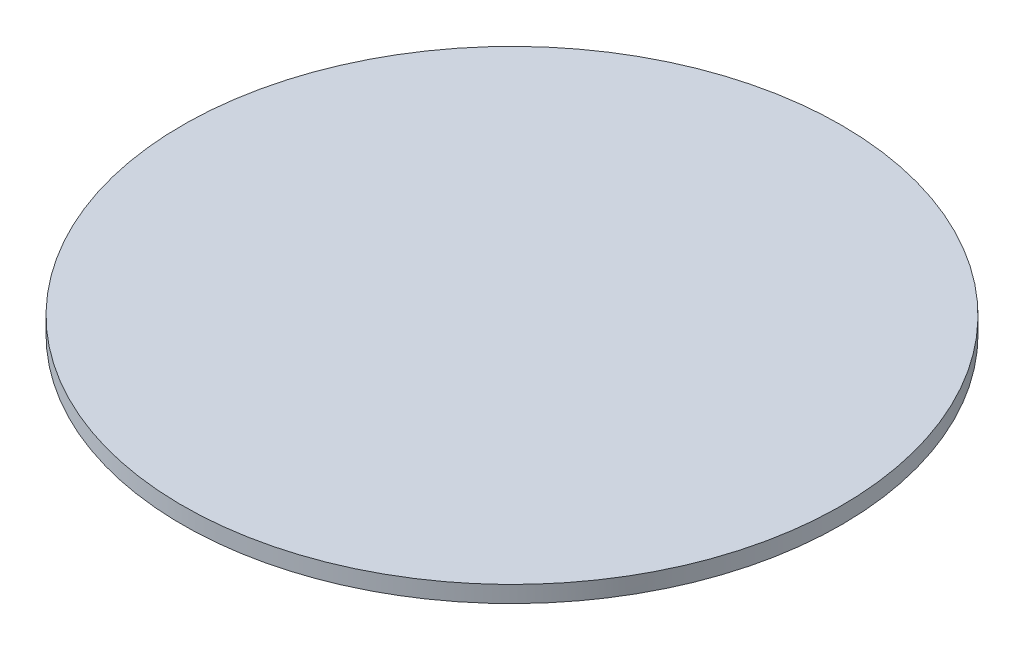
ISO-10303-21;
HEADER;
FILE_DESCRIPTION(('STEP AP214'),'2;1');
FILE_NAME('part.step','',(''),(''),'','','');
FILE_SCHEMA(('AUTOMOTIVE_DESIGN { 1 0 10303 214 1 1 1 1 }'));
ENDSEC;
DATA;
#1=APPLICATION_CONTEXT('core data for automotive mechanical design processes');
#2=APPLICATION_PROTOCOL_DEFINITION('international standard','automotive_design',2000,#1);
#3=PRODUCT_CONTEXT('',#1,'mechanical');
#4=PRODUCT('Part','Part','',(#3));
#5=PRODUCT_RELATED_PRODUCT_CATEGORY('part','',(#4));
#6=PRODUCT_DEFINITION_FORMATION('','',#4);
#7=PRODUCT_DEFINITION_CONTEXT('part definition',#1,'design');
#8=PRODUCT_DEFINITION('design','',#6,#7);
#9=PRODUCT_DEFINITION_SHAPE('','',#8);
#10=(LENGTH_UNIT() NAMED_UNIT(*) SI_UNIT(.MILLI.,.METRE.));
#11=(NAMED_UNIT(*) PLANE_ANGLE_UNIT() SI_UNIT($,.RADIAN.));
#12=(NAMED_UNIT(*) SI_UNIT($,.STERADIAN.) SOLID_ANGLE_UNIT());
#13=UNCERTAINTY_MEASURE_WITH_UNIT(LENGTH_MEASURE(1.E-05),#10,'distance_accuracy_value','');
#14=(GEOMETRIC_REPRESENTATION_CONTEXT(3) GLOBAL_UNCERTAINTY_ASSIGNED_CONTEXT((#13)) GLOBAL_UNIT_ASSIGNED_CONTEXT((#10,
#11,#12)) REPRESENTATION_CONTEXT('',''));
#15=CARTESIAN_POINT('',(0.,0.,0.));
#16=DIRECTION('',(0.,0.,1.));
#17=DIRECTION('',(1.,0.,0.));
#18=AXIS2_PLACEMENT_3D('',#15,#16,#17);
#19=CARTESIAN_POINT('',(21.2731331748166,3.24918533795984,102.377891347207));
#20=CARTESIAN_POINT('',(22.5518424825592,3.24918533795984,102.377891347207));
#21=CARTESIAN_POINT('',(25.1092610980446,3.24918533795984,102.629775095617));
#22=CARTESIAN_POINT('',(28.7979687765083,3.24918533795984,103.748732336676));
#23=CARTESIAN_POINT('',(32.1975012427753,3.24918533795984,105.565820296922));
#24=CARTESIAN_POINT('',(35.177216370647,3.24918533795984,108.011209305078));
#25=CARTESIAN_POINT('',(37.6226053788025,3.24918533795984,110.99092443295));
#26=CARTESIAN_POINT('',(39.4396933390486,3.24918533795984,114.390456899217));
#27=CARTESIAN_POINT('',(40.5586505801075,3.24918533795984,118.07916457768));
#28=CARTESIAN_POINT('',(40.9364762027238,3.24918533795984,121.915292500908));
#29=CARTESIAN_POINT('',(40.5586505801075,3.24918533795984,125.751420424136));
#30=CARTESIAN_POINT('',(39.4396933390486,3.24918533795984,129.4401281026));
#31=CARTESIAN_POINT('',(37.6226053788025,3.24918533795984,132.839660568867));
#32=CARTESIAN_POINT('',(35.177216370647,3.24918533795984,135.819375696739));
#33=CARTESIAN_POINT('',(32.1975012427753,3.24918533795984,138.264764704894));
#34=CARTESIAN_POINT('',(28.7979687765083,3.24918533795984,140.08185266514));
#35=CARTESIAN_POINT('',(25.1092610980446,3.24918533795984,141.200809906199));
#36=CARTESIAN_POINT('',(21.2731331748166,3.24918533795984,141.578635528816));
#37=CARTESIAN_POINT('',(17.4370052515886,3.24918533795984,141.200809906199));
#38=CARTESIAN_POINT('',(13.7482975731249,3.24918533795984,140.08185266514));
#39=CARTESIAN_POINT('',(10.3487651068578,3.24918533795984,138.264764704894));
#40=CARTESIAN_POINT('',(7.36904997898615,3.24918533795984,135.819375696739));
#41=CARTESIAN_POINT('',(4.92366097083058,3.24918533795984,132.839660568867));
#42=CARTESIAN_POINT('',(3.10657301058456,3.24918533795984,129.4401281026));
#43=CARTESIAN_POINT('',(1.98761576952567,3.24918533795984,125.751420424136));
#44=CARTESIAN_POINT('',(1.60979014690934,3.24918533795984,121.915292500908));
#45=CARTESIAN_POINT('',(1.98761576952566,3.24918533795984,118.07916457768));
#46=CARTESIAN_POINT('',(3.10657301058456,3.24918533795984,114.390456899217));
#47=CARTESIAN_POINT('',(4.92366097083058,3.24918533795984,110.99092443295));
#48=CARTESIAN_POINT('',(7.36904997898614,3.24918533795984,108.011209305078));
#49=CARTESIAN_POINT('',(10.3487651068578,3.24918533795984,105.565820296922));
#50=CARTESIAN_POINT('',(13.7482975731249,3.24918533795984,103.748732336676));
#51=CARTESIAN_POINT('',(17.4370052515886,3.24918533795984,102.629775095617));
#52=CARTESIAN_POINT('',(19.9944238670739,3.24918533795984,102.377891347207));
#53=CARTESIAN_POINT('',(21.2731331748166,3.24918533795984,102.377891347207));
#54=B_SPLINE_CURVE_WITH_KNOTS('',3,(#19,#20,#21,#22,#23,#24,#25,#26,#27,#28,#29,#30,#31,#32,#33,
#34,#35,#36,#37,#38,#39,#40,#41,#42,#43,#44,#45,#46,#47,#48,#49,#50,#51,#52,#53),.UNSPECIFIED.,
.T.,.F.,(4,1,1,1,1,1,1,1,1,1,1,1,1,1,1,1,1,1,1,1,1,1,1,1,1,1,1,1,1,1,1,1,4),(0.,
0.0312499999999999,0.0625,0.09375,0.125,0.15625,0.1875,0.21875,0.25,0.28125,0.3125,0.34375,
0.375,0.40625,0.4375,0.46875,0.5,0.53125,0.5625,0.59375,0.625,0.65625,0.6875,0.71875,0.75,
0.78125,0.8125,0.84375,0.875,0.90625,0.9375,0.96875,1.),.UNSPECIFIED.);
#55=DIRECTION('',(0.,-1.,0.));
#56=VECTOR('',#55,1.);
#57=SURFACE_OF_LINEAR_EXTRUSION('',#54,#56);
#58=CARTESIAN_POINT('',(21.2731331748166,3.24918533795984,102.377891347207));
#59=CARTESIAN_POINT('',(22.5518424825592,3.24918533795984,102.377891347207));
#60=CARTESIAN_POINT('',(25.1092610980446,3.24918533795984,102.629775095617));
#61=CARTESIAN_POINT('',(28.7979687765083,3.24918533795984,103.748732336676));
#62=CARTESIAN_POINT('',(32.1975012427753,3.24918533795984,105.565820296922));
#63=CARTESIAN_POINT('',(35.177216370647,3.24918533795984,108.011209305078));
#64=CARTESIAN_POINT('',(37.6226053788025,3.24918533795984,110.99092443295));
#65=CARTESIAN_POINT('',(39.4396933390486,3.24918533795984,114.390456899217));
#66=CARTESIAN_POINT('',(40.5586505801075,3.24918533795984,118.07916457768));
#67=CARTESIAN_POINT('',(40.9364762027238,3.24918533795984,121.915292500908));
#68=CARTESIAN_POINT('',(40.5586505801075,3.24918533795984,125.751420424136));
#69=CARTESIAN_POINT('',(39.4396933390486,3.24918533795984,129.4401281026));
#70=CARTESIAN_POINT('',(37.6226053788025,3.24918533795984,132.839660568867));
#71=CARTESIAN_POINT('',(35.177216370647,3.24918533795984,135.819375696739));
#72=CARTESIAN_POINT('',(32.1975012427753,3.24918533795984,138.264764704894));
#73=CARTESIAN_POINT('',(28.7979687765083,3.24918533795984,140.08185266514));
#74=CARTESIAN_POINT('',(25.1092610980446,3.24918533795984,141.200809906199));
#75=CARTESIAN_POINT('',(21.2731331748166,3.24918533795984,141.578635528816));
#76=CARTESIAN_POINT('',(17.4370052515886,3.24918533795984,141.200809906199));
#77=CARTESIAN_POINT('',(13.7482975731249,3.24918533795984,140.08185266514));
#78=CARTESIAN_POINT('',(10.3487651068578,3.24918533795984,138.264764704894));
#79=CARTESIAN_POINT('',(7.36904997898615,3.24918533795984,135.819375696739));
#80=CARTESIAN_POINT('',(4.92366097083058,3.24918533795984,132.839660568867));
#81=CARTESIAN_POINT('',(3.10657301058456,3.24918533795984,129.4401281026));
#82=CARTESIAN_POINT('',(1.98761576952567,3.24918533795984,125.751420424136));
#83=CARTESIAN_POINT('',(1.60979014690934,3.24918533795984,121.915292500908));
#84=CARTESIAN_POINT('',(1.98761576952566,3.24918533795984,118.07916457768));
#85=CARTESIAN_POINT('',(3.10657301058456,3.24918533795984,114.390456899217));
#86=CARTESIAN_POINT('',(4.92366097083058,3.24918533795984,110.99092443295));
#87=CARTESIAN_POINT('',(7.36904997898614,3.24918533795984,108.011209305078));
#88=CARTESIAN_POINT('',(10.3487651068578,3.24918533795984,105.565820296922));
#89=CARTESIAN_POINT('',(13.7482975731249,3.24918533795984,103.748732336676));
#90=CARTESIAN_POINT('',(17.4370052515886,3.24918533795984,102.629775095617));
#91=CARTESIAN_POINT('',(19.9944238670739,3.24918533795984,102.377891347207));
#92=CARTESIAN_POINT('',(21.2731331748166,3.24918533795984,102.377891347207));
#93=B_SPLINE_CURVE_WITH_KNOTS('',3,(#58,#59,#60,#61,#62,#63,#64,#65,#66,#67,#68,#69,#70,#71,#72,
#73,#74,#75,#76,#77,#78,#79,#80,#81,#82,#83,#84,#85,#86,#87,#88,#89,#90,#91,#92),.UNSPECIFIED.,
.T.,.F.,(4,1,1,1,1,1,1,1,1,1,1,1,1,1,1,1,1,1,1,1,1,1,1,1,1,1,1,1,1,1,1,1,4),(0.,
0.0312499999999999,0.0625,0.09375,0.125,0.15625,0.1875,0.21875,0.25,0.28125,0.3125,0.34375,
0.375,0.40625,0.4375,0.46875,0.5,0.53125,0.5625,0.59375,0.625,0.65625,0.6875,0.71875,0.75,
0.78125,0.8125,0.84375,0.875,0.90625,0.9375,0.96875,1.),.UNSPECIFIED.);
#94=CARTESIAN_POINT('',(21.2731331748166,3.24918533795984,102.377891347207));
#95=VERTEX_POINT('',#94);
#96=EDGE_CURVE('E9',#95,#95,#93,.T.);
#97=ORIENTED_EDGE('',*,*,#96,.T.);
#98=EDGE_LOOP('',(#97));
#99=FACE_BOUND('',#98,.T.);
#100=CARTESIAN_POINT('',(21.2731331748166,2.26610024094684,102.377891347207));
#101=CARTESIAN_POINT('',(20.9534538849464,2.26610024094684,102.377891413515));
#102=CARTESIAN_POINT('',(20.6337769216615,2.26610024094684,102.385762808348));
#103=CARTESIAN_POINT('',(19.9951907999093,2.26610024094684,102.417172587829));
#104=CARTESIAN_POINT('',(19.6762816474255,2.26610024094684,102.440711094176));
#105=CARTESIAN_POINT('',(19.0399992891781,2.26610024094684,102.503379427095));
#106=CARTESIAN_POINT('',(18.7226260834145,2.26610024094684,102.542509253668));
#107=CARTESIAN_POINT('',(18.0901818096652,2.26610024094684,102.636285079453));
#108=CARTESIAN_POINT('',(17.7751107238161,2.26610024094684,102.690930958136));
#109=CARTESIAN_POINT('',(17.1480398609491,2.26610024094684,102.815663105913));
#110=CARTESIAN_POINT('',(16.8360400839313,2.26610024094684,102.885749375006));
#111=CARTESIAN_POINT('',(16.2158512640616,2.26610024094684,103.041137771615));
#112=CARTESIAN_POINT('',(15.9076622508299,2.26610024094684,103.126440017321));
#113=CARTESIAN_POINT('',(15.2958320512569,2.26610024094684,103.31203667904));
#114=CARTESIAN_POINT('',(14.9921908649155,2.26610024094684,103.412331095052));
#115=CARTESIAN_POINT('',(14.3901935366709,2.26610024094684,103.627688814235));
#116=CARTESIAN_POINT('',(14.0918373537326,2.26610024094684,103.742752002677));
#117=CARTESIAN_POINT('',(13.501149529916,2.26610024094684,103.987422910405));
#118=CARTESIAN_POINT('',(13.2088178890376,2.26610024094684,104.11703062969));
#119=CARTESIAN_POINT('',(12.6308605921862,2.26610024094684,104.390426119311));
#120=CARTESIAN_POINT('',(12.3452349883222,2.26610024094684,104.534213999788));
#121=CARTESIAN_POINT('',(11.7813690479351,2.26610024094684,104.835606624106));
#122=CARTESIAN_POINT('',(11.503128711412,2.26610024094684,104.993211367947));
#123=CARTESIAN_POINT('',(10.9547127995542,2.26610024094684,105.321874901627));
#124=CARTESIAN_POINT('',(10.6845371615907,2.26610024094684,105.492933586949));
#125=CARTESIAN_POINT('',(10.1529321649234,2.26610024094684,105.848140689533));
#126=CARTESIAN_POINT('',(9.89150280621962,2.26610024094684,106.032289106795));
#127=CARTESIAN_POINT('',(9.37798761085564,2.26610024094684,106.413185253903));
#128=CARTESIAN_POINT('',(9.12590184679061,2.26610024094684,106.609933081608));
#129=CARTESIAN_POINT('',(8.63166921647461,2.26610024094684,107.015539319044));
#130=CARTESIAN_POINT('',(8.38952235022364,2.26610024094684,107.224397728775));
#131=CARTESIAN_POINT('',(7.91576317095395,2.26610024094684,107.653736721657));
#132=CARTESIAN_POINT('',(7.68415077611925,2.26610024094684,107.874217214517));
#133=CARTESIAN_POINT('',(7.23205788842505,2.26610024094684,108.326310102211));
#134=CARTESIAN_POINT('',(7.01157739556555,2.26610024094684,108.557922497046));
#135=CARTESIAN_POINT('',(6.5822384026831,2.26610024094684,109.031681676315));
#136=CARTESIAN_POINT('',(6.37337999295179,2.26610024094684,109.273828542566));
#137=CARTESIAN_POINT('',(5.967773755516,2.26610024094684,109.768061172882));
#138=CARTESIAN_POINT('',(5.77102592781153,2.26610024094684,110.020146936947));
#139=CARTESIAN_POINT('',(5.39012978070341,2.26610024094684,110.533662132311));
#140=CARTESIAN_POINT('',(5.20598136344083,2.26610024094684,110.795091491015));
#141=CARTESIAN_POINT('',(4.85077426085684,2.26610024094684,111.326696487682));
#142=CARTESIAN_POINT('',(4.67971557553542,2.26610024094684,111.596872125645));
#143=CARTESIAN_POINT('',(4.35105204185499,2.26610024094684,112.145288037504));
#144=CARTESIAN_POINT('',(4.19344729801418,2.26610024094684,112.423528374029));
#145=CARTESIAN_POINT('',(3.89205467369665,2.26610024094684,112.987394314411));
#146=CARTESIAN_POINT('',(3.74826679321992,2.26610024094684,113.273019918268));
#147=CARTESIAN_POINT('',(3.47487130359773,2.26610024094684,113.850977215139));
#148=CARTESIAN_POINT('',(3.34526358431105,2.26610024094684,114.143308856043));
#149=CARTESIAN_POINT('',(3.10059267658712,2.26610024094684,114.733996679789));
#150=CARTESIAN_POINT('',(2.98552948814987,2.26610024094684,115.032352862629));
#151=CARTESIAN_POINT('',(2.77017176895415,2.26610024094684,115.63435019114));
#152=CARTESIAN_POINT('',(2.66987735292391,2.26610024094684,115.937991377846));
#153=CARTESIAN_POINT('',(2.48428069125422,2.26610024094684,116.549821576424));
#154=CARTESIAN_POINT('',(2.39897844561477,2.26610024094684,116.858010588298));
#155=CARTESIAN_POINT('',(2.24359004882273,2.26610024094684,117.478199411878));
#156=CARTESIAN_POINT('',(2.17350377947929,2.26610024094684,117.790199193965));
#157=CARTESIAN_POINT('',(2.04877163238623,2.26610024094684,118.417270042984));
#158=CARTESIAN_POINT('',(1.99412575463661,2.26610024094684,118.732341109916));
#159=CARTESIAN_POINT('',(1.90034992630031,2.26610024094684,119.364785435348));
#160=CARTESIAN_POINT('',(1.86122009624291,2.26610024094684,119.682158711712));
#161=CARTESIAN_POINT('',(1.79855177284522,2.26610024094684,120.318440877075));
#162=CARTESIAN_POINT('',(1.77501327950494,2.26610024094684,120.637349766073));
#163=CARTESIAN_POINT('',(1.74360346448895,2.26610024094684,121.275936607679));
#164=CARTESIAN_POINT('',(1.73573202111478,2.26610024094684,121.595614554294));
#165=CARTESIAN_POINT('',(1.73573202111478,2.26610024094684,122.234970447523));
#166=CARTESIAN_POINT('',(1.74360346448895,2.26610024094684,122.554648394138));
#167=CARTESIAN_POINT('',(1.77501327950494,2.26610024094684,123.193235235744));
#168=CARTESIAN_POINT('',(1.79855177284523,2.26610024094684,123.512144124742));
#169=CARTESIAN_POINT('',(1.86122009624291,2.26610024094684,124.148426290104));
#170=CARTESIAN_POINT('',(1.90034992630031,2.26610024094684,124.465799566469));
#171=CARTESIAN_POINT('',(1.99412575463661,2.26610024094684,125.098243891901));
#172=CARTESIAN_POINT('',(2.04877163238623,2.26610024094684,125.413314958833));
#173=CARTESIAN_POINT('',(2.17350377947929,2.26610024094684,126.040385807852));
#174=CARTESIAN_POINT('',(2.24359004882273,2.26610024094684,126.352385589938));
#175=CARTESIAN_POINT('',(2.39897844561477,2.26610024094684,126.972574413519));
#176=CARTESIAN_POINT('',(2.48428069125422,2.26610024094684,127.280763425392));
#177=CARTESIAN_POINT('',(2.66987735292391,2.26610024094684,127.892593623971));
#178=CARTESIAN_POINT('',(2.77017176895415,2.26610024094684,128.196234810676));
#179=CARTESIAN_POINT('',(2.98552948814986,2.26610024094684,128.798232139187));
#180=CARTESIAN_POINT('',(3.10059267658712,2.26610024094684,129.096588322028));
#181=CARTESIAN_POINT('',(3.34526358431105,2.26610024094684,129.687276145773));
#182=CARTESIAN_POINT('',(3.47487130359772,2.26610024094684,129.979607786678));
#183=CARTESIAN_POINT('',(3.74826679321991,2.26610024094684,130.557565083548));
#184=CARTESIAN_POINT('',(3.89205467369665,2.26610024094684,130.843190687405));
#185=CARTESIAN_POINT('',(4.19344729801418,2.26610024094684,131.407056627787));
#186=CARTESIAN_POINT('',(4.35105204185498,2.26610024094684,131.685296964312));
#187=CARTESIAN_POINT('',(4.67971557553541,2.26610024094684,132.233712876171));
#188=CARTESIAN_POINT('',(4.85077426085683,2.26610024094684,132.503888514134));
#189=CARTESIAN_POINT('',(5.20598136344083,2.26610024094684,133.035493510801));
#190=CARTESIAN_POINT('',(5.39012978070341,2.26610024094684,133.296922869505));
#191=CARTESIAN_POINT('',(5.77102592781152,2.26610024094684,133.810438064869));
#192=CARTESIAN_POINT('',(5.96777375551599,2.26610024094684,134.062523828934));
#193=CARTESIAN_POINT('',(6.37337999295178,2.26610024094684,134.55675645925));
#194=CARTESIAN_POINT('',(6.5822384026831,2.26610024094684,134.798903325501));
#195=CARTESIAN_POINT('',(7.01157739556555,2.26610024094684,135.272662504771));
#196=CARTESIAN_POINT('',(7.23205788842504,2.26610024094684,135.504274899606));
#197=CARTESIAN_POINT('',(7.68415077611924,2.26610024094684,135.9563677873));
#198=CARTESIAN_POINT('',(7.91576317095394,2.26610024094684,136.176848280159));
#199=CARTESIAN_POINT('',(8.38952235022364,2.26610024094684,136.606187273042));
#200=CARTESIAN_POINT('',(8.63166921647462,2.26610024094684,136.815045682773));
#201=CARTESIAN_POINT('',(9.12590184679059,2.26610024094684,137.220651920209));
#202=CARTESIAN_POINT('',(9.37798761085558,2.26610024094684,137.417399747913));
#203=CARTESIAN_POINT('',(9.89150280621966,2.26610024094684,137.798295895021));
#204=CARTESIAN_POINT('',(10.1529321649235,2.26610024094684,137.982444312284));
#205=CARTESIAN_POINT('',(10.6845371615905,2.26610024094684,138.337651414868));
#206=CARTESIAN_POINT('',(10.9547127995535,2.26610024094684,138.508710100189));
#207=CARTESIAN_POINT('',(11.5031287114127,2.26610024094684,138.83737363387));
#208=CARTESIAN_POINT('',(11.7813690479376,2.26610024094684,138.994978377711));
#209=CARTESIAN_POINT('',(12.3452349883196,2.26610024094684,139.296371002028));
#210=CARTESIAN_POINT('',(12.6308605921766,2.26610024094684,139.440158882505));
#211=CARTESIAN_POINT('',(13.2088178890471,2.26610024094684,139.713554372127));
#212=CARTESIAN_POINT('',(13.5011495299517,2.26610024094684,139.843162091414));
#213=CARTESIAN_POINT('',(14.0918373536969,2.26610024094684,140.087832999138));
#214=CARTESIAN_POINT('',(14.3901935365376,2.26610024094684,140.202896187575));
#215=CARTESIAN_POINT('',(14.9921908650487,2.26610024094684,140.418253906771));
#216=CARTESIAN_POINT('',(15.295832051754,2.26610024094684,140.518548322801));
#217=CARTESIAN_POINT('',(15.9076622503328,2.26610024094684,140.704144984471));
#218=CARTESIAN_POINT('',(16.2158512622062,2.26610024094684,140.78944723011));
#219=CARTESIAN_POINT('',(16.8360400857866,2.26610024094684,140.944835626902));
#220=CARTESIAN_POINT('',(17.1480398678733,2.26610024094684,141.014921896246));
#221=CARTESIAN_POINT('',(17.7751107168919,2.26610024094684,141.139654043339));
#222=CARTESIAN_POINT('',(18.0901817838238,2.26610024094684,141.194299921088));
#223=CARTESIAN_POINT('',(18.722626109256,2.26610024094684,141.288075749425));
#224=CARTESIAN_POINT('',(19.0399993856206,2.26610024094684,141.327205579482));
#225=CARTESIAN_POINT('',(19.676281550983,2.26610024094684,141.38987390288));
#226=CARTESIAN_POINT('',(19.995190439981,2.26610024094684,141.41341239622));
#227=CARTESIAN_POINT('',(20.633777281587,2.26610024094684,141.444822211236));
#228=CARTESIAN_POINT('',(20.9534552282018,2.26610024094684,141.45269365461));
#229=CARTESIAN_POINT('',(21.5928111214313,2.26610024094684,141.45269365461));
#230=CARTESIAN_POINT('',(21.9124890680461,2.26610024094684,141.444822211236));
#231=CARTESIAN_POINT('',(22.5510759096521,2.26610024094684,141.41341239622));
#232=CARTESIAN_POINT('',(22.86998479865,2.26610024094684,141.38987390288));
#233=CARTESIAN_POINT('',(23.5062669640125,2.26610024094684,141.327205579482));
#234=CARTESIAN_POINT('',(23.823640240377,2.26610024094684,141.288075749425));
#235=CARTESIAN_POINT('',(24.4560845658093,2.26610024094684,141.194299921088));
#236=CARTESIAN_POINT('',(24.7711556327412,2.26610024094684,141.139654043339));
#237=CARTESIAN_POINT('',(25.3982264817598,2.26610024094684,141.014921896246));
#238=CARTESIAN_POINT('',(25.7102262638465,2.26610024094684,140.944835626902));
#239=CARTESIAN_POINT('',(26.3304150874269,2.26610024094684,140.78944723011));
#240=CARTESIAN_POINT('',(26.6386040993003,2.26610024094684,140.704144984471));
#241=CARTESIAN_POINT('',(27.2504342978791,2.26610024094684,140.518548322801));
#242=CARTESIAN_POINT('',(27.5540754845844,2.26610024094684,140.418253906771));
#243=CARTESIAN_POINT('',(28.1560728130955,2.26610024094684,140.202896187575));
#244=CARTESIAN_POINT('',(28.4544289959362,2.26610024094684,140.087832999138));
#245=CARTESIAN_POINT('',(29.0451168196814,2.26610024094684,139.843162091414));
#246=CARTESIAN_POINT('',(29.337448460586,2.26610024094684,139.713554372127));
#247=CARTESIAN_POINT('',(29.9154057574565,2.26610024094684,139.440158882505));
#248=CARTESIAN_POINT('',(30.2010313613135,2.26610024094684,139.296371002028));
#249=CARTESIAN_POINT('',(30.7648973016954,2.26610024094684,138.994978377711));
#250=CARTESIAN_POINT('',(31.0431376382204,2.26610024094684,138.83737363387));
#251=CARTESIAN_POINT('',(31.5915535500796,2.26610024094684,138.508710100189));
#252=CARTESIAN_POINT('',(31.8617291880426,2.26610024094684,138.337651414868));
#253=CARTESIAN_POINT('',(32.3933341847096,2.26610024094684,137.982444312284));
#254=CARTESIAN_POINT('',(32.6547635434134,2.26610024094684,137.798295895021));
#255=CARTESIAN_POINT('',(33.1682787387775,2.26610024094684,137.417399747913));
#256=CARTESIAN_POINT('',(33.4203645028425,2.26610024094684,137.220651920209));
#257=CARTESIAN_POINT('',(33.9145971331585,2.26610024094684,136.815045682773));
#258=CARTESIAN_POINT('',(34.1567439994095,2.26610024094684,136.606187273042));
#259=CARTESIAN_POINT('',(34.6305031786791,2.26610024094684,136.176848280159));
#260=CARTESIAN_POINT('',(34.8621155735139,2.26610024094684,135.9563677873));
#261=CARTESIAN_POINT('',(35.3142084612081,2.26610024094684,135.504274899606));
#262=CARTESIAN_POINT('',(35.5346889540676,2.26610024094684,135.272662504771));
#263=CARTESIAN_POINT('',(35.96402794695,2.26610024094684,134.798903325501));
#264=CARTESIAN_POINT('',(36.1728863566813,2.26610024094684,134.55675645925));
#265=CARTESIAN_POINT('',(36.5784925941171,2.26610024094684,134.062523828934));
#266=CARTESIAN_POINT('',(36.7752404218216,2.26610024094684,133.810438064869));
#267=CARTESIAN_POINT('',(37.1561365689297,2.26610024094684,133.296922869505));
#268=CARTESIAN_POINT('',(37.3402849861923,2.26610024094684,133.035493510801));
#269=CARTESIAN_POINT('',(37.6954920887763,2.26610024094684,132.503888514134));
#270=CARTESIAN_POINT('',(37.8665507740977,2.26610024094684,132.233712876171));
#271=CARTESIAN_POINT('',(38.1952143077781,2.26610024094684,131.685296964312));
#272=CARTESIAN_POINT('',(38.3528190516189,2.26610024094684,131.407056627787));
#273=CARTESIAN_POINT('',(38.6542116759365,2.26610024094684,130.843190687405));
#274=CARTESIAN_POINT('',(38.7979995564132,2.26610024094684,130.557565083548));
#275=CARTESIAN_POINT('',(39.0713950460354,2.26610024094684,129.979607786678));
#276=CARTESIAN_POINT('',(39.2010027653221,2.26610024094684,129.687276145773));
#277=CARTESIAN_POINT('',(39.445673673046,2.26610024094684,129.096588322028));
#278=CARTESIAN_POINT('',(39.5607368614833,2.26610024094684,128.798232139187));
#279=CARTESIAN_POINT('',(39.776094580679,2.26610024094684,128.196234810676));
#280=CARTESIAN_POINT('',(39.8763889967092,2.26610024094684,127.892593623971));
#281=CARTESIAN_POINT('',(40.0619856583789,2.26610024094684,127.280763425392));
#282=CARTESIAN_POINT('',(40.1472879040184,2.26610024094684,126.972574413519));
#283=CARTESIAN_POINT('',(40.3026763008104,2.26610024094684,126.352385589938));
#284=CARTESIAN_POINT('',(40.3727625701538,2.26610024094684,126.040385807852));
#285=CARTESIAN_POINT('',(40.4974947172469,2.26610024094684,125.413314958833));
#286=CARTESIAN_POINT('',(40.5521405949965,2.26610024094684,125.098243891901));
#287=CARTESIAN_POINT('',(40.6459164233328,2.26610024094684,124.465799566469));
#288=CARTESIAN_POINT('',(40.6850462533902,2.26610024094684,124.148426290104));
#289=CARTESIAN_POINT('',(40.7477145767879,2.26610024094684,123.512144124742));
#290=CARTESIAN_POINT('',(40.7712530701282,2.26610024094684,123.193235235744));
#291=CARTESIAN_POINT('',(40.8026628851442,2.26610024094684,122.554648394138));
#292=CARTESIAN_POINT('',(40.8105343285183,2.26610024094684,122.234970447523));
#293=CARTESIAN_POINT('',(40.8105343285183,2.26610024094684,121.595614554294));
#294=CARTESIAN_POINT('',(40.8026628851442,2.26610024094684,121.275936607679));
#295=CARTESIAN_POINT('',(40.7712530701282,2.26610024094684,120.637349766073));
#296=CARTESIAN_POINT('',(40.7477145767879,2.26610024094684,120.318440877075));
#297=CARTESIAN_POINT('',(40.6850462533902,2.26610024094684,119.682158711712));
#298=CARTESIAN_POINT('',(40.6459164233328,2.26610024094684,119.364785435348));
#299=CARTESIAN_POINT('',(40.5521405949965,2.26610024094684,118.732341109916));
#300=CARTESIAN_POINT('',(40.4974947172469,2.26610024094684,118.417270042984));
#301=CARTESIAN_POINT('',(40.3727625701538,2.26610024094684,117.790199193965));
#302=CARTESIAN_POINT('',(40.3026763008104,2.26610024094684,117.478199411878));
#303=CARTESIAN_POINT('',(40.1472879040184,2.26610024094684,116.858010588298));
#304=CARTESIAN_POINT('',(40.0619856583789,2.26610024094684,116.549821576425));
#305=CARTESIAN_POINT('',(39.8763889967092,2.26610024094684,115.937991377846));
#306=CARTESIAN_POINT('',(39.776094580679,2.26610024094684,115.63435019114));
#307=CARTESIAN_POINT('',(39.5607368614833,2.26610024094684,115.032352862629));
#308=CARTESIAN_POINT('',(39.445673673046,2.26610024094684,114.733996679789));
#309=CARTESIAN_POINT('',(39.2010027653221,2.26610024094684,114.143308856043));
#310=CARTESIAN_POINT('',(39.0713950460354,2.26610024094684,113.850977215139));
#311=CARTESIAN_POINT('',(38.7979995564132,2.26610024094684,113.273019918268));
#312=CARTESIAN_POINT('',(38.6542116759365,2.26610024094684,112.987394314411));
#313=CARTESIAN_POINT('',(38.3528190516189,2.26610024094684,112.423528374029));
#314=CARTESIAN_POINT('',(38.1952143077781,2.26610024094684,112.145288037504));
#315=CARTESIAN_POINT('',(37.8665507740977,2.26610024094684,111.596872125645));
#316=CARTESIAN_POINT('',(37.6954920887763,2.26610024094684,111.326696487682));
#317=CARTESIAN_POINT('',(37.3402849861923,2.26610024094684,110.795091491015));
#318=CARTESIAN_POINT('',(37.1561365689297,2.26610024094684,110.533662132311));
#319=CARTESIAN_POINT('',(36.7752404218216,2.26610024094684,110.020146936947));
#320=CARTESIAN_POINT('',(36.5784925941171,2.26610024094684,109.768061172882));
#321=CARTESIAN_POINT('',(36.1728863566813,2.26610024094684,109.273828542566));
#322=CARTESIAN_POINT('',(35.96402794695,2.26610024094684,109.031681676315));
#323=CARTESIAN_POINT('',(35.5346889540676,2.26610024094684,108.557922497046));
#324=CARTESIAN_POINT('',(35.3142084612081,2.26610024094684,108.326310102211));
#325=CARTESIAN_POINT('',(34.8621155735139,2.26610024094684,107.874217214517));
#326=CARTESIAN_POINT('',(34.6305031786792,2.26610024094684,107.653736721657));
#327=CARTESIAN_POINT('',(34.1567439994095,2.26610024094684,107.224397728775));
#328=CARTESIAN_POINT('',(33.9145971331585,2.26610024094684,107.015539319044));
#329=CARTESIAN_POINT('',(33.4203645028425,2.26610024094684,106.609933081608));
#330=CARTESIAN_POINT('',(33.1682787387775,2.26610024094684,106.413185253903));
#331=CARTESIAN_POINT('',(32.6547635434135,2.26610024094684,106.032289106795));
#332=CARTESIAN_POINT('',(32.3933341847098,2.26610024094684,105.848140689533));
#333=CARTESIAN_POINT('',(31.8617291880425,2.26610024094684,105.492933586949));
#334=CARTESIAN_POINT('',(31.5915535500789,2.26610024094684,105.321874901627));
#335=CARTESIAN_POINT('',(31.0431376382211,2.26610024094684,104.993211367947));
#336=CARTESIAN_POINT('',(30.764897301698,2.26610024094684,104.835606624106));
#337=CARTESIAN_POINT('',(30.2010313613109,2.26610024094684,104.534213999788));
#338=CARTESIAN_POINT('',(29.9154057574469,2.26610024094684,104.390426119311));
#339=CARTESIAN_POINT('',(29.3374484605955,2.26610024094684,104.11703062969));
#340=CARTESIAN_POINT('',(29.0451168197172,2.26610024094684,103.987422910405));
#341=CARTESIAN_POINT('',(28.4544289959005,2.26610024094684,103.742752002677));
#342=CARTESIAN_POINT('',(28.1560728129623,2.26610024094684,103.627688814235));
#343=CARTESIAN_POINT('',(27.5540754847176,2.26610024094684,103.412331095052));
#344=CARTESIAN_POINT('',(27.2504342983763,2.26610024094684,103.31203667904));
#345=CARTESIAN_POINT('',(26.6386040988032,2.26610024094684,103.126440017321));
#346=CARTESIAN_POINT('',(26.3304150855716,2.26610024094684,103.041137771615));
#347=CARTESIAN_POINT('',(25.7102262657019,2.26610024094684,102.885749375006));
#348=CARTESIAN_POINT('',(25.398226488684,2.26610024094684,102.815663105913));
#349=CARTESIAN_POINT('',(24.771155625817,2.26610024094684,102.690930958136));
#350=CARTESIAN_POINT('',(24.4560845399679,2.26610024094684,102.636285079453));
#351=CARTESIAN_POINT('',(23.8236402662187,2.26610024094684,102.542509253668));
#352=CARTESIAN_POINT('',(23.506267060455,2.26610024094684,102.503379427095));
#353=CARTESIAN_POINT('',(22.8699847022076,2.26610024094684,102.440711094176));
#354=CARTESIAN_POINT('',(22.5510755497238,2.26610024094684,102.417172587829));
#355=CARTESIAN_POINT('',(21.9124894279716,2.26610024094684,102.385762808348));
#356=CARTESIAN_POINT('',(21.5928124646867,2.26610024094684,102.377891413515));
#357=CARTESIAN_POINT('',(21.2731331748166,2.26610024094684,102.377891347207));
#358=B_SPLINE_CURVE_WITH_KNOTS('',3,(#100,#101,#102,#103,#104,#105,#106,#107,#108,#109,#110,
#111,#112,#113,#114,#115,#116,#117,#118,#119,#120,#121,#122,#123,#124,#125,#126,#127,#128,#129,
#130,#131,#132,#133,#134,#135,#136,#137,#138,#139,#140,#141,#142,#143,#144,#145,#146,#147,#148,
#149,#150,#151,#152,#153,#154,#155,#156,#157,#158,#159,#160,#161,#162,#163,#164,#165,#166,#167,
#168,#169,#170,#171,#172,#173,#174,#175,#176,#177,#178,#179,#180,#181,#182,#183,#184,#185,#186,
#187,#188,#189,#190,#191,#192,#193,#194,#195,#196,#197,#198,#199,#200,#201,#202,#203,#204,#205,
#206,#207,#208,#209,#210,#211,#212,#213,#214,#215,#216,#217,#218,#219,#220,#221,#222,#223,#224,
#225,#226,#227,#228,#229,#230,#231,#232,#233,#234,#235,#236,#237,#238,#239,#240,#241,#242,#243,
#244,#245,#246,#247,#248,#249,#250,#251,#252,#253,#254,#255,#256,#257,#258,#259,#260,#261,#262,
#263,#264,#265,#266,#267,#268,#269,#270,#271,#272,#273,#274,#275,#276,#277,#278,#279,#280,#281,
#282,#283,#284,#285,#286,#287,#288,#289,#290,#291,#292,#293,#294,#295,#296,#297,#298,#299,#300,
#301,#302,#303,#304,#305,#306,#307,#308,#309,#310,#311,#312,#313,#314,#315,#316,#317,#318,#319,
#320,#321,#322,#323,#324,#325,#326,#327,#328,#329,#330,#331,#332,#333,#334,#335,#336,#337,#338,
#339,#340,#341,#342,#343,#344,#345,#346,#347,#348,#349,#350,#351,#352,#353,#354,#355,#356,#357),
.UNSPECIFIED.,.F.,.F.,(4,2,2,2,2,2,2,2,2,2,2,2,2,2,2,2,2,2,2,2,2,2,2,2,2,2,2,2,2,2,2,2,2,2,2,2,
2,2,2,2,2,2,2,2,2,2,2,2,2,2,2,2,2,2,2,2,2,2,2,2,2,2,2,2,2,2,2,2,2,2,2,2,2,2,2,2,2,2,2,2,2,2,2,2,
2,2,2,2,2,2,2,2,2,2,2,2,2,2,2,2,2,2,2,2,2,2,2,2,2,2,2,2,2,2,2,2,2,2,2,2,2,2,2,2,2,2,2,2,4),(0.,
0.958937939115206,1.91788332715285,2.87682871519048,3.83576665430568,4.79470459342088,
5.75364998145852,6.71259536949616,7.67153330861136,8.63047124772657,9.58941663576422,
10.5483620238019,11.5072999629171,12.4662379020323,13.4251832900699,14.3841286781075,
15.3430666172227,16.3020045563379,17.2609499443756,18.2198953324132,19.1788332715284,
20.1377712106436,21.0967165986813,22.0556619867189,23.0145999258341,23.9735378649493,
24.9324832529869,25.8914286410246,26.8503665801398,27.809304519255,28.7682499072926,
29.7271952953302,30.6861332344454,31.6450711735606,32.6040165615983,33.5629619496359,
34.5218998887511,35.4808378278664,36.439783215904,37.3987286039416,38.3576665430568,
39.3166044821721,40.2755498702097,41.2344952582473,42.1934331973625,43.1523711364777,
44.1113165245154,45.070261912553,46.0291998516682,46.9881377907834,47.947083178821,
48.9060285668587,49.8649665059739,50.8239044450891,51.7828498331267,52.7417952211644,
53.7007331602796,54.6596710993948,55.6186164874324,56.57756187547,57.5364998145852,
58.4954377537005,59.4543831417381,60.4133285297757,61.3722664688909,62.3312044080061,
63.2901497960438,64.2490951840814,65.2080331231966,66.1669710623118,67.1259164503495,
68.0848618383871,69.0437997775023,70.0027377166175,70.9616831046551,71.9206284926928,
72.879566431808,73.8385043709232,74.7974497589608,75.7563951469985,76.7153330861137,
77.6742710252289,78.6332164132665,79.5921618013042,80.5510997404193,81.5100376795346,
82.4689830675722,83.4279284556099,84.3868663947251,85.3458043338403,86.3047497218779,
87.2636951099155,88.2226330490307,89.1815709881459,90.1405163761835,91.0994617642212,
92.0583997033364,93.0173376424516,93.9762830304893,94.9352284185269,95.8941663576421,
96.8531042967573,97.812049684795,98.7709950728326,99.7299330119478,100.688870951063,
101.647816339101,102.606761727138,103.565699666253,104.524637605369,105.483582993406,
106.442528381444,107.401466320559,108.360404259674,109.319349647712,110.27829503575,
111.237232974865,112.19617091398,113.155116302018,114.114061690055,115.07299962917,
116.031937568286,116.990882956323,117.949828344361,118.908766283476,119.867704222591,
120.826649610629,121.785594998667,122.744532937782),.UNSPECIFIED.);
#359=CARTESIAN_POINT('',(21.2731331748166,2.26610024094684,102.377891347207));
#360=VERTEX_POINT('',#359);
#361=EDGE_CURVE('E24',#360,#360,#358,.F.);
#362=ORIENTED_EDGE('',*,*,#361,.F.);
#363=EDGE_LOOP('',(#362));
#364=FACE_BOUND('',#363,.T.);
#365=ADVANCED_FACE('F14',(#99,#364),#57,.T.);
#366=CARTESIAN_POINT('',(59.0486320515157,3.24918533795985,92.8386680530653));
#367=DIRECTION('',(0.,-1.,0.));
#368=DIRECTION('',(1.,0.,0.));
#369=AXIS2_PLACEMENT_3D('',#366,#367,#368);
#370=PLANE('',#369);
#371=ORIENTED_EDGE('',*,*,#96,.F.);
#372=EDGE_LOOP('',(#371));
#373=FACE_BOUND('',#372,.T.);
#374=ADVANCED_FACE('F62',(#373),#370,.F.);
#375=CARTESIAN_POINT('',(59.0486320515157,2.26610024094684,92.8386680530653));
#376=DIRECTION('',(0.,-1.,0.));
#377=DIRECTION('',(1.,0.,0.));
#378=AXIS2_PLACEMENT_3D('',#375,#376,#377);
#379=PLANE('',#378);
#380=ORIENTED_EDGE('',*,*,#361,.T.);
#381=EDGE_LOOP('',(#380));
#382=FACE_BOUND('',#381,.T.);
#383=ADVANCED_FACE('F31',(#382),#379,.T.);
#384=CLOSED_SHELL('',(#365,#374,#383));
#385=MANIFOLD_SOLID_BREP('B1',#384);
#386=ADVANCED_BREP_SHAPE_REPRESENTATION('',(#18,#385),#14);
#387=SHAPE_DEFINITION_REPRESENTATION(#9,#386);
ENDSEC;
END-ISO-10303-21;
